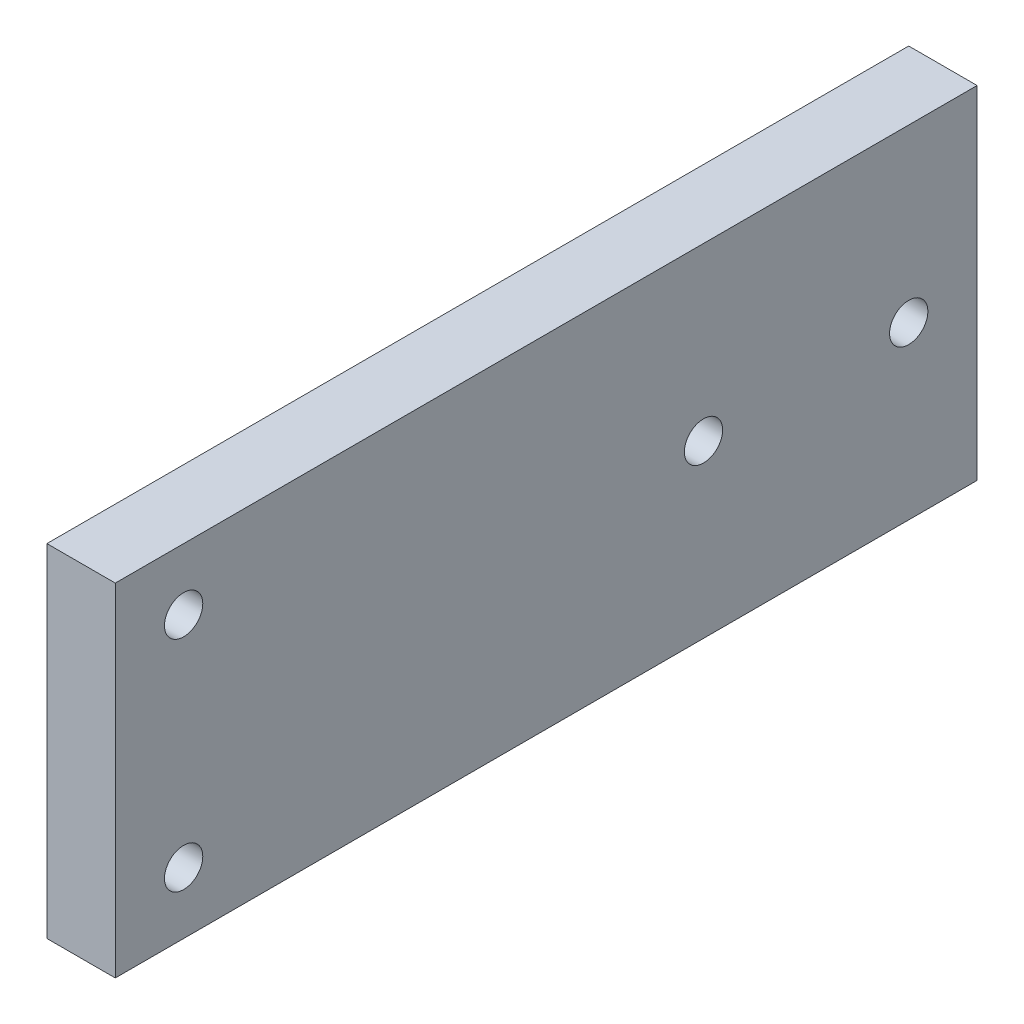
ISO-10303-21;
HEADER;
FILE_DESCRIPTION(('STEP AP214'),'2;1');
FILE_NAME('part.step','',(''),(''),'','','');
FILE_SCHEMA(('AUTOMOTIVE_DESIGN { 1 0 10303 214 1 1 1 1 }'));
ENDSEC;
DATA;
#1=APPLICATION_CONTEXT('core data for automotive mechanical design processes');
#2=APPLICATION_PROTOCOL_DEFINITION('international standard','automotive_design',2000,#1);
#3=PRODUCT_CONTEXT('',#1,'mechanical');
#4=PRODUCT('Part','Part','',(#3));
#5=PRODUCT_RELATED_PRODUCT_CATEGORY('part','',(#4));
#6=PRODUCT_DEFINITION_FORMATION('','',#4);
#7=PRODUCT_DEFINITION_CONTEXT('part definition',#1,'design');
#8=PRODUCT_DEFINITION('design','',#6,#7);
#9=PRODUCT_DEFINITION_SHAPE('','',#8);
#10=(LENGTH_UNIT() NAMED_UNIT(*) SI_UNIT(.MILLI.,.METRE.));
#11=(NAMED_UNIT(*) PLANE_ANGLE_UNIT() SI_UNIT($,.RADIAN.));
#12=(NAMED_UNIT(*) SI_UNIT($,.STERADIAN.) SOLID_ANGLE_UNIT());
#13=UNCERTAINTY_MEASURE_WITH_UNIT(LENGTH_MEASURE(1.E-05),#10,'distance_accuracy_value','');
#14=(GEOMETRIC_REPRESENTATION_CONTEXT(3) GLOBAL_UNCERTAINTY_ASSIGNED_CONTEXT((#13)) GLOBAL_UNIT_ASSIGNED_CONTEXT((#10,
#11,#12)) REPRESENTATION_CONTEXT('',''));
#15=CARTESIAN_POINT('',(0.,0.,0.));
#16=DIRECTION('',(0.,0.,1.));
#17=DIRECTION('',(1.,0.,0.));
#18=AXIS2_PLACEMENT_3D('',#15,#16,#17);
#19=CARTESIAN_POINT('',(2.5,0.,0.));
#20=DIRECTION('',(-1.,0.,0.));
#21=DIRECTION('',(0.,0.,1.));
#22=AXIS2_PLACEMENT_3D('',#19,#20,#21);
#23=PLANE('',#22);
#24=DIRECTION('',(0.,1.,0.));
#25=VECTOR('',#24,1.);
#26=CARTESIAN_POINT('',(2.5,-2.22044604925031E-13,-62.9950000000004));
#27=LINE('',#26,#25);
#28=CARTESIAN_POINT('',(2.5,-2.22044604925031E-13,-62.9950000000004));
#29=VERTEX_POINT('',#28);
#30=CARTESIAN_POINT('',(2.5,24.9999999999999,-62.9950000000001));
#31=VERTEX_POINT('',#30);
#32=EDGE_CURVE('E86',#29,#31,#27,.T.);
#33=ORIENTED_EDGE('',*,*,#32,.T.);
#34=DIRECTION('',(0.,0.,1.));
#35=VECTOR('',#34,1.);
#36=CARTESIAN_POINT('',(2.5,24.9999999999999,0.));
#37=LINE('',#36,#35);
#38=CARTESIAN_POINT('',(2.5,24.9999999999999,0.));
#39=VERTEX_POINT('',#38);
#40=EDGE_CURVE('E81',#31,#39,#37,.T.);
#41=ORIENTED_EDGE('',*,*,#40,.T.);
#42=DIRECTION('',(0.,-1.,0.));
#43=VECTOR('',#42,1.);
#44=CARTESIAN_POINT('',(2.5,24.9999999999999,0.));
#45=LINE('',#44,#43);
#46=CARTESIAN_POINT('',(2.5,0.,0.));
#47=VERTEX_POINT('',#46);
#48=EDGE_CURVE('E84',#39,#47,#45,.T.);
#49=ORIENTED_EDGE('',*,*,#48,.T.);
#50=DIRECTION('',(0.,0.,-1.));
#51=VECTOR('',#50,1.);
#52=CARTESIAN_POINT('',(2.5,-2.22044604925031E-13,-62.9950000000004));
#53=LINE('',#52,#51);
#54=EDGE_CURVE('E51',#47,#29,#53,.T.);
#55=ORIENTED_EDGE('',*,*,#54,.T.);
#56=EDGE_LOOP('',(#33,#41,#49,#55));
#57=FACE_BOUND('',#56,.T.);
#58=CARTESIAN_POINT('',(2.5,4.49999999999995,-4.99500000000008));
#59=DIRECTION('',(1.,0.,0.));
#60=DIRECTION('',(0.,0.,-1.));
#61=AXIS2_PLACEMENT_3D('',#58,#59,#60);
#62=CIRCLE('',#61,1.40000000000007);
#63=CARTESIAN_POINT('',(2.5,4.49999999999995,-6.39500000000015));
#64=VERTEX_POINT('',#63);
#65=EDGE_CURVE('E101',#64,#64,#62,.T.);
#66=ORIENTED_EDGE('',*,*,#65,.F.);
#67=EDGE_LOOP('',(#66));
#68=FACE_BOUND('',#67,.T.);
#69=CARTESIAN_POINT('',(2.5,20.5,-4.99500000000008));
#70=DIRECTION('',(1.,0.,0.));
#71=DIRECTION('',(0.,0.,-1.));
#72=AXIS2_PLACEMENT_3D('',#69,#70,#71);
#73=CIRCLE('',#72,1.40000000000007);
#74=CARTESIAN_POINT('',(2.5,20.5,-6.39500000000015));
#75=VERTEX_POINT('',#74);
#76=EDGE_CURVE('E116',#75,#75,#73,.T.);
#77=ORIENTED_EDGE('',*,*,#76,.F.);
#78=EDGE_LOOP('',(#77));
#79=FACE_BOUND('',#78,.T.);
#80=CARTESIAN_POINT('',(2.5,12.4999999999997,-42.9950000000003));
#81=DIRECTION('',(1.,0.,0.));
#82=DIRECTION('',(0.,0.,-1.));
#83=AXIS2_PLACEMENT_3D('',#80,#81,#82);
#84=CIRCLE('',#83,1.40000000000007);
#85=CARTESIAN_POINT('',(2.5,12.4999999999997,-44.3950000000004));
#86=VERTEX_POINT('',#85);
#87=EDGE_CURVE('E122',#86,#86,#84,.T.);
#88=ORIENTED_EDGE('',*,*,#87,.F.);
#89=EDGE_LOOP('',(#88));
#90=FACE_BOUND('',#89,.T.);
#91=CARTESIAN_POINT('',(2.5,12.4999999999997,-57.9950000000002));
#92=DIRECTION('',(1.,0.,0.));
#93=DIRECTION('',(0.,0.,-1.));
#94=AXIS2_PLACEMENT_3D('',#91,#92,#93);
#95=CIRCLE('',#94,1.40000000000007);
#96=CARTESIAN_POINT('',(2.5,12.4999999999997,-59.3950000000003));
#97=VERTEX_POINT('',#96);
#98=EDGE_CURVE('E128',#97,#97,#95,.T.);
#99=ORIENTED_EDGE('',*,*,#98,.F.);
#100=EDGE_LOOP('',(#99));
#101=FACE_BOUND('',#100,.T.);
#102=ADVANCED_FACE('F34',(#57,#68,#79,#90,#101),#23,.F.);
#103=CARTESIAN_POINT('',(-2.5,0.,0.));
#104=DIRECTION('',(-1.,0.,0.));
#105=DIRECTION('',(0.,0.,1.));
#106=AXIS2_PLACEMENT_3D('',#103,#104,#105);
#107=PLANE('',#106);
#108=CARTESIAN_POINT('',(-2.5,12.4999999999997,-42.9950000000003));
#109=DIRECTION('',(1.,0.,0.));
#110=DIRECTION('',(0.,0.,-1.));
#111=AXIS2_PLACEMENT_3D('',#108,#109,#110);
#112=CIRCLE('',#111,1.40000000000007);
#113=CARTESIAN_POINT('',(-2.5,12.4999999999997,-44.3950000000004));
#114=VERTEX_POINT('',#113);
#115=EDGE_CURVE('E125',#114,#114,#112,.T.);
#116=ORIENTED_EDGE('',*,*,#115,.T.);
#117=EDGE_LOOP('',(#116));
#118=FACE_BOUND('',#117,.T.);
#119=CARTESIAN_POINT('',(-2.5,4.49999999999995,-4.99500000000008));
#120=DIRECTION('',(1.,0.,0.));
#121=DIRECTION('',(0.,0.,-1.));
#122=AXIS2_PLACEMENT_3D('',#119,#120,#121);
#123=CIRCLE('',#122,1.40000000000007);
#124=CARTESIAN_POINT('',(-2.5,4.49999999999995,-6.39500000000015));
#125=VERTEX_POINT('',#124);
#126=EDGE_CURVE('E113',#125,#125,#123,.T.);
#127=ORIENTED_EDGE('',*,*,#126,.T.);
#128=EDGE_LOOP('',(#127));
#129=FACE_BOUND('',#128,.T.);
#130=DIRECTION('',(0.,1.,0.));
#131=VECTOR('',#130,1.);
#132=CARTESIAN_POINT('',(-2.5,-2.22044604925031E-13,-62.9950000000004));
#133=LINE('',#132,#131);
#134=CARTESIAN_POINT('',(-2.5,-2.22044604925031E-13,-62.9950000000004));
#135=VERTEX_POINT('',#134);
#136=CARTESIAN_POINT('',(-2.5,24.9999999999999,-62.9950000000001));
#137=VERTEX_POINT('',#136);
#138=EDGE_CURVE('E98',#135,#137,#133,.T.);
#139=ORIENTED_EDGE('',*,*,#138,.F.);
#140=DIRECTION('',(0.,0.,-1.));
#141=VECTOR('',#140,1.);
#142=CARTESIAN_POINT('',(-2.5,-2.22044604925031E-13,-62.9950000000004));
#143=LINE('',#142,#141);
#144=CARTESIAN_POINT('',(-2.5,0.,0.));
#145=VERTEX_POINT('',#144);
#146=EDGE_CURVE('E74',#145,#135,#143,.T.);
#147=ORIENTED_EDGE('',*,*,#146,.F.);
#148=DIRECTION('',(0.,-1.,0.));
#149=VECTOR('',#148,1.);
#150=CARTESIAN_POINT('',(-2.5,24.9999999999999,0.));
#151=LINE('',#150,#149);
#152=CARTESIAN_POINT('',(-2.5,24.9999999999999,0.));
#153=VERTEX_POINT('',#152);
#154=EDGE_CURVE('E68',#153,#145,#151,.T.);
#155=ORIENTED_EDGE('',*,*,#154,.F.);
#156=DIRECTION('',(0.,0.,1.));
#157=VECTOR('',#156,1.);
#158=CARTESIAN_POINT('',(-2.5,24.9999999999999,0.));
#159=LINE('',#158,#157);
#160=EDGE_CURVE('E90',#137,#153,#159,.T.);
#161=ORIENTED_EDGE('',*,*,#160,.F.);
#162=EDGE_LOOP('',(#139,#147,#155,#161));
#163=FACE_BOUND('',#162,.T.);
#164=CARTESIAN_POINT('',(-2.5,20.5,-4.99500000000008));
#165=DIRECTION('',(1.,0.,0.));
#166=DIRECTION('',(0.,0.,-1.));
#167=AXIS2_PLACEMENT_3D('',#164,#165,#166);
#168=CIRCLE('',#167,1.40000000000007);
#169=CARTESIAN_POINT('',(-2.5,20.5,-6.39500000000015));
#170=VERTEX_POINT('',#169);
#171=EDGE_CURVE('E119',#170,#170,#168,.T.);
#172=ORIENTED_EDGE('',*,*,#171,.T.);
#173=EDGE_LOOP('',(#172));
#174=FACE_BOUND('',#173,.T.);
#175=CARTESIAN_POINT('',(-2.5,12.4999999999997,-57.9950000000002));
#176=DIRECTION('',(1.,0.,0.));
#177=DIRECTION('',(0.,0.,-1.));
#178=AXIS2_PLACEMENT_3D('',#175,#176,#177);
#179=CIRCLE('',#178,1.40000000000007);
#180=CARTESIAN_POINT('',(-2.5,12.4999999999997,-59.3950000000003));
#181=VERTEX_POINT('',#180);
#182=EDGE_CURVE('E131',#181,#181,#179,.T.);
#183=ORIENTED_EDGE('',*,*,#182,.T.);
#184=EDGE_LOOP('',(#183));
#185=FACE_BOUND('',#184,.T.);
#186=ADVANCED_FACE('F109',(#118,#129,#163,#174,#185),#107,.T.);
#187=CARTESIAN_POINT('',(2.5,-2.22044604925031E-13,-62.9950000000004));
#188=DIRECTION('',(0.,0.,1.));
#189=DIRECTION('',(0.,-1.,0.));
#190=AXIS2_PLACEMENT_3D('',#187,#188,#189);
#191=PLANE('',#190);
#192=ORIENTED_EDGE('',*,*,#138,.T.);
#193=DIRECTION('',(-1.,0.,0.));
#194=VECTOR('',#193,1.);
#195=CARTESIAN_POINT('',(2.5,24.9999999999999,-62.9950000000001));
#196=LINE('',#195,#194);
#197=EDGE_CURVE('E11',#31,#137,#196,.T.);
#198=ORIENTED_EDGE('',*,*,#197,.F.);
#199=ORIENTED_EDGE('',*,*,#32,.F.);
#200=DIRECTION('',(-1.,0.,0.));
#201=VECTOR('',#200,1.);
#202=CARTESIAN_POINT('',(2.5,-2.22044604925031E-13,-62.9950000000004));
#203=LINE('',#202,#201);
#204=EDGE_CURVE('E94',#29,#135,#203,.T.);
#205=ORIENTED_EDGE('',*,*,#204,.T.);
#206=EDGE_LOOP('',(#192,#198,#199,#205));
#207=FACE_BOUND('',#206,.T.);
#208=ADVANCED_FACE('F36',(#207),#191,.F.);
#209=CARTESIAN_POINT('',(2.5,24.9999999999999,0.));
#210=DIRECTION('',(0.,-1.,0.));
#211=DIRECTION('',(0.,0.,-1.));
#212=AXIS2_PLACEMENT_3D('',#209,#210,#211);
#213=PLANE('',#212);
#214=ORIENTED_EDGE('',*,*,#160,.T.);
#215=DIRECTION('',(-1.,0.,0.));
#216=VECTOR('',#215,1.);
#217=CARTESIAN_POINT('',(2.5,24.9999999999999,0.));
#218=LINE('',#217,#216);
#219=EDGE_CURVE('E43',#39,#153,#218,.T.);
#220=ORIENTED_EDGE('',*,*,#219,.F.);
#221=ORIENTED_EDGE('',*,*,#40,.F.);
#222=ORIENTED_EDGE('',*,*,#197,.T.);
#223=EDGE_LOOP('',(#214,#220,#221,#222));
#224=FACE_BOUND('',#223,.T.);
#225=ADVANCED_FACE('F89',(#224),#213,.F.);
#226=CARTESIAN_POINT('',(2.5,24.9999999999999,0.));
#227=DIRECTION('',(0.,0.,-1.));
#228=DIRECTION('',(-1.,0.,0.));
#229=AXIS2_PLACEMENT_3D('',#226,#227,#228);
#230=PLANE('',#229);
#231=ORIENTED_EDGE('',*,*,#154,.T.);
#232=DIRECTION('',(-1.,0.,0.));
#233=VECTOR('',#232,1.);
#234=CARTESIAN_POINT('',(2.5,0.,0.));
#235=LINE('',#234,#233);
#236=EDGE_CURVE('E91',#47,#145,#235,.T.);
#237=ORIENTED_EDGE('',*,*,#236,.F.);
#238=ORIENTED_EDGE('',*,*,#48,.F.);
#239=ORIENTED_EDGE('',*,*,#219,.T.);
#240=EDGE_LOOP('',(#231,#237,#238,#239));
#241=FACE_BOUND('',#240,.T.);
#242=ADVANCED_FACE('F92',(#241),#230,.F.);
#243=CARTESIAN_POINT('',(2.5,-2.22044604925031E-13,-62.9950000000004));
#244=DIRECTION('',(0.,1.,0.));
#245=DIRECTION('',(0.,0.,1.));
#246=AXIS2_PLACEMENT_3D('',#243,#244,#245);
#247=PLANE('',#246);
#248=ORIENTED_EDGE('',*,*,#146,.T.);
#249=ORIENTED_EDGE('',*,*,#204,.F.);
#250=ORIENTED_EDGE('',*,*,#54,.F.);
#251=ORIENTED_EDGE('',*,*,#236,.T.);
#252=EDGE_LOOP('',(#248,#249,#250,#251));
#253=FACE_BOUND('',#252,.T.);
#254=ADVANCED_FACE('F106',(#253),#247,.F.);
#255=CARTESIAN_POINT('',(2.5,4.49999999999995,-4.99500000000008));
#256=DIRECTION('',(-1.,0.,0.));
#257=DIRECTION('',(0.,0.,1.));
#258=AXIS2_PLACEMENT_3D('',#255,#256,#257);
#259=CYLINDRICAL_SURFACE('',#258,1.40000000000007);
#260=ORIENTED_EDGE('',*,*,#65,.T.);
#261=EDGE_LOOP('',(#260));
#262=FACE_BOUND('',#261,.T.);
#263=ORIENTED_EDGE('',*,*,#126,.F.);
#264=EDGE_LOOP('',(#263));
#265=FACE_BOUND('',#264,.T.);
#266=ADVANCED_FACE('F148',(#262,#265),#259,.F.);
#267=CARTESIAN_POINT('',(2.5,20.5,-4.99500000000008));
#268=DIRECTION('',(-1.,0.,0.));
#269=DIRECTION('',(0.,0.,1.));
#270=AXIS2_PLACEMENT_3D('',#267,#268,#269);
#271=CYLINDRICAL_SURFACE('',#270,1.40000000000007);
#272=ORIENTED_EDGE('',*,*,#76,.T.);
#273=EDGE_LOOP('',(#272));
#274=FACE_BOUND('',#273,.T.);
#275=ORIENTED_EDGE('',*,*,#171,.F.);
#276=EDGE_LOOP('',(#275));
#277=FACE_BOUND('',#276,.T.);
#278=ADVANCED_FACE('F194',(#274,#277),#271,.F.);
#279=CARTESIAN_POINT('',(2.5,12.4999999999997,-42.9950000000003));
#280=DIRECTION('',(-1.,0.,0.));
#281=DIRECTION('',(0.,0.,1.));
#282=AXIS2_PLACEMENT_3D('',#279,#280,#281);
#283=CYLINDRICAL_SURFACE('',#282,1.40000000000007);
#284=ORIENTED_EDGE('',*,*,#87,.T.);
#285=EDGE_LOOP('',(#284));
#286=FACE_BOUND('',#285,.T.);
#287=ORIENTED_EDGE('',*,*,#115,.F.);
#288=EDGE_LOOP('',(#287));
#289=FACE_BOUND('',#288,.T.);
#290=ADVANCED_FACE('F202',(#286,#289),#283,.F.);
#291=CARTESIAN_POINT('',(2.5,12.4999999999997,-57.9950000000002));
#292=DIRECTION('',(-1.,0.,0.));
#293=DIRECTION('',(0.,0.,1.));
#294=AXIS2_PLACEMENT_3D('',#291,#292,#293);
#295=CYLINDRICAL_SURFACE('',#294,1.40000000000007);
#296=ORIENTED_EDGE('',*,*,#98,.T.);
#297=EDGE_LOOP('',(#296));
#298=FACE_BOUND('',#297,.T.);
#299=ORIENTED_EDGE('',*,*,#182,.F.);
#300=EDGE_LOOP('',(#299));
#301=FACE_BOUND('',#300,.T.);
#302=ADVANCED_FACE('F137',(#298,#301),#295,.F.);
#303=CLOSED_SHELL('',(#102,#186,#208,#225,#242,#254,#266,#278,#290,#302));
#304=MANIFOLD_SOLID_BREP('B2',#303);
#305=ADVANCED_BREP_SHAPE_REPRESENTATION('',(#18,#304),#14);
#306=SHAPE_DEFINITION_REPRESENTATION(#9,#305);
ENDSEC;
END-ISO-10303-21;
